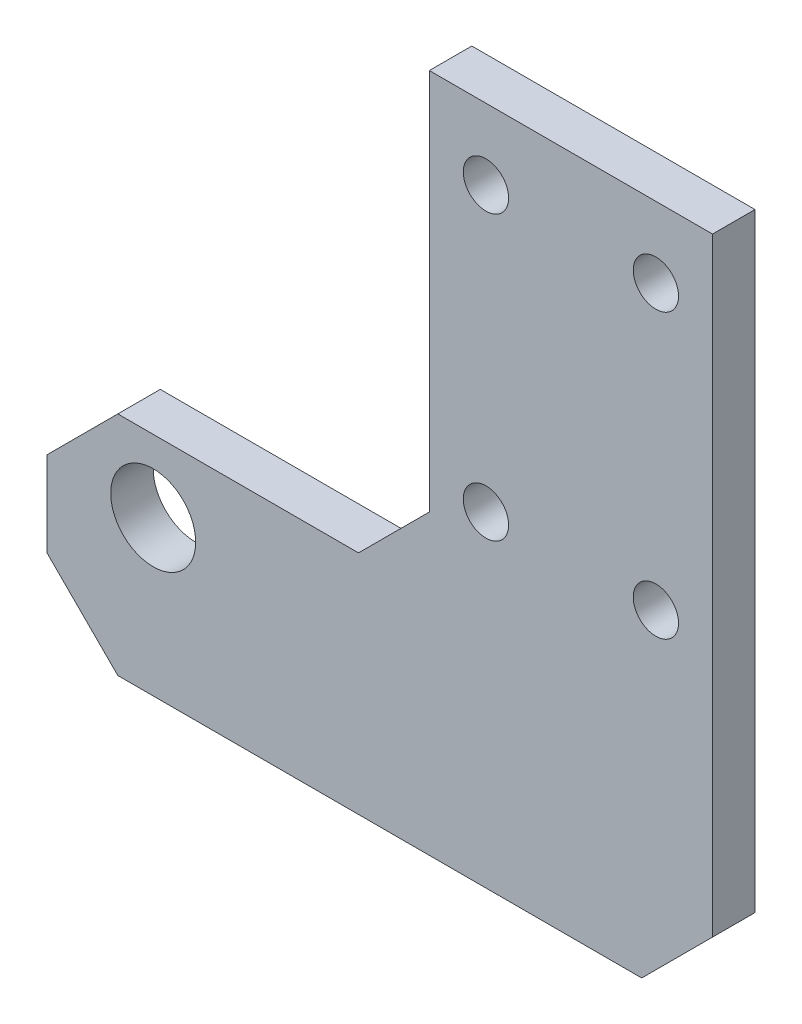
ISO-10303-21;
HEADER;
FILE_DESCRIPTION(('STEP AP214'),'2;1');
FILE_NAME('part.step','',(''),(''),'','','');
FILE_SCHEMA(('AUTOMOTIVE_DESIGN { 1 0 10303 214 1 1 1 1 }'));
ENDSEC;
DATA;
#1=APPLICATION_CONTEXT('core data for automotive mechanical design processes');
#2=APPLICATION_PROTOCOL_DEFINITION('international standard','automotive_design',2000,#1);
#3=PRODUCT_CONTEXT('',#1,'mechanical');
#4=PRODUCT('Part','Part','',(#3));
#5=PRODUCT_RELATED_PRODUCT_CATEGORY('part','',(#4));
#6=PRODUCT_DEFINITION_FORMATION('','',#4);
#7=PRODUCT_DEFINITION_CONTEXT('part definition',#1,'design');
#8=PRODUCT_DEFINITION('design','',#6,#7);
#9=PRODUCT_DEFINITION_SHAPE('','',#8);
#10=(LENGTH_UNIT() NAMED_UNIT(*) SI_UNIT(.MILLI.,.METRE.));
#11=(NAMED_UNIT(*) PLANE_ANGLE_UNIT() SI_UNIT($,.RADIAN.));
#12=(NAMED_UNIT(*) SI_UNIT($,.STERADIAN.) SOLID_ANGLE_UNIT());
#13=UNCERTAINTY_MEASURE_WITH_UNIT(LENGTH_MEASURE(1.E-05),#10,'distance_accuracy_value','');
#14=(GEOMETRIC_REPRESENTATION_CONTEXT(3) GLOBAL_UNCERTAINTY_ASSIGNED_CONTEXT((#13)) GLOBAL_UNIT_ASSIGNED_CONTEXT((#10,
#11,#12)) REPRESENTATION_CONTEXT('',''));
#15=CARTESIAN_POINT('',(0.,0.,0.));
#16=DIRECTION('',(0.,0.,1.));
#17=DIRECTION('',(1.,0.,0.));
#18=AXIS2_PLACEMENT_3D('',#15,#16,#17);
#19=CARTESIAN_POINT('',(0.,0.,3.));
#20=DIRECTION('',(0.,0.,-1.));
#21=DIRECTION('',(-1.,0.,0.));
#22=AXIS2_PLACEMENT_3D('',#19,#20,#21);
#23=PLANE('',#22);
#24=DIRECTION('',(0.,-1.,0.));
#25=VECTOR('',#24,1.);
#26=CARTESIAN_POINT('',(330.612129760226,-150.,3.));
#27=LINE('',#26,#25);
#28=CARTESIAN_POINT('',(330.612129760226,-150.,3.));
#29=VERTEX_POINT('',#28);
#30=CARTESIAN_POINT('',(330.612129760226,-177.,3.));
#31=VERTEX_POINT('',#30);
#32=EDGE_CURVE('E164',#29,#31,#27,.T.);
#33=ORIENTED_EDGE('',*,*,#32,.T.);
#34=DIRECTION('',(-0.707106781186547,-0.707106781186547,0.));
#35=VECTOR('',#34,1.);
#36=CARTESIAN_POINT('',(330.612129760226,-177.,3.));
#37=LINE('',#36,#35);
#38=CARTESIAN_POINT('',(325.612129760226,-182.,3.));
#39=VERTEX_POINT('',#38);
#40=EDGE_CURVE('E101',#31,#39,#37,.T.);
#41=ORIENTED_EDGE('',*,*,#40,.T.);
#42=DIRECTION('',(-1.,0.,0.));
#43=VECTOR('',#42,1.);
#44=CARTESIAN_POINT('',(325.612129760226,-182.,3.));
#45=LINE('',#44,#43);
#46=CARTESIAN_POINT('',(308.612129760226,-182.,3.));
#47=VERTEX_POINT('',#46);
#48=EDGE_CURVE('E185',#39,#47,#45,.T.);
#49=ORIENTED_EDGE('',*,*,#48,.T.);
#50=DIRECTION('',(-0.707106781186547,-0.707106781186547,0.));
#51=VECTOR('',#50,1.);
#52=CARTESIAN_POINT('',(308.612129760226,-182.,3.));
#53=LINE('',#52,#51);
#54=CARTESIAN_POINT('',(303.612129760226,-187.,3.));
#55=VERTEX_POINT('',#54);
#56=EDGE_CURVE('E204',#47,#55,#53,.T.);
#57=ORIENTED_EDGE('',*,*,#56,.T.);
#58=DIRECTION('',(0.,-1.,0.));
#59=VECTOR('',#58,1.);
#60=CARTESIAN_POINT('',(303.612129760226,-193.,3.));
#61=LINE('',#60,#59);
#62=CARTESIAN_POINT('',(303.612129760226,-193.,3.));
#63=VERTEX_POINT('',#62);
#64=EDGE_CURVE('E201',#55,#63,#61,.T.);
#65=ORIENTED_EDGE('',*,*,#64,.T.);
#66=DIRECTION('',(0.707106781186547,-0.707106781186547,0.));
#67=VECTOR('',#66,1.);
#68=CARTESIAN_POINT('',(308.612129760226,-198.,3.));
#69=LINE('',#68,#67);
#70=CARTESIAN_POINT('',(308.612129760226,-198.,3.));
#71=VERTEX_POINT('',#70);
#72=EDGE_CURVE('E203',#63,#71,#69,.T.);
#73=ORIENTED_EDGE('',*,*,#72,.T.);
#74=DIRECTION('',(1.,0.,0.));
#75=VECTOR('',#74,1.);
#76=CARTESIAN_POINT('',(330.612129760226,-198.,3.));
#77=LINE('',#76,#75);
#78=CARTESIAN_POINT('',(345.612129760226,-198.,3.));
#79=VERTEX_POINT('',#78);
#80=EDGE_CURVE('E126',#71,#79,#77,.T.);
#81=ORIENTED_EDGE('',*,*,#80,.T.);
#82=DIRECTION('',(0.707106781186547,0.707106781186547,0.));
#83=VECTOR('',#82,1.);
#84=CARTESIAN_POINT('',(345.612129760226,-198.,3.));
#85=LINE('',#84,#83);
#86=CARTESIAN_POINT('',(350.612129760226,-193.,3.));
#87=VERTEX_POINT('',#86);
#88=EDGE_CURVE('E120',#79,#87,#85,.T.);
#89=ORIENTED_EDGE('',*,*,#88,.T.);
#90=DIRECTION('',(0.,1.,0.));
#91=VECTOR('',#90,1.);
#92=CARTESIAN_POINT('',(350.612129760226,-150.,3.));
#93=LINE('',#92,#91);
#94=CARTESIAN_POINT('',(350.612129760226,-150.,3.));
#95=VERTEX_POINT('',#94);
#96=EDGE_CURVE('E124',#87,#95,#93,.T.);
#97=ORIENTED_EDGE('',*,*,#96,.T.);
#98=DIRECTION('',(-1.,0.,0.));
#99=VECTOR('',#98,1.);
#100=CARTESIAN_POINT('',(330.612129760226,-150.,3.));
#101=LINE('',#100,#99);
#102=EDGE_CURVE('E52',#95,#29,#101,.T.);
#103=ORIENTED_EDGE('',*,*,#102,.T.);
#104=EDGE_LOOP('',(#33,#41,#49,#57,#65,#73,#81,#89,#97,#103));
#105=FACE_BOUND('',#104,.T.);
#106=CARTESIAN_POINT('',(311.112129760226,-187.1,3.));
#107=DIRECTION('',(0.,0.,1.));
#108=DIRECTION('',(1.,0.,0.));
#109=AXIS2_PLACEMENT_3D('',#106,#107,#108);
#110=CIRCLE('',#109,2.99999999999999);
#111=CARTESIAN_POINT('',(314.112129760226,-187.1,3.));
#112=VERTEX_POINT('',#111);
#113=EDGE_CURVE('E148',#112,#112,#110,.T.);
#114=ORIENTED_EDGE('',*,*,#113,.F.);
#115=EDGE_LOOP('',(#114));
#116=FACE_BOUND('',#115,.T.);
#117=CARTESIAN_POINT('',(334.612129760226,-155.,3.));
#118=DIRECTION('',(0.,0.,1.));
#119=DIRECTION('',(1.,0.,0.));
#120=AXIS2_PLACEMENT_3D('',#117,#118,#119);
#121=CIRCLE('',#120,1.59999999999996);
#122=CARTESIAN_POINT('',(336.212129760226,-155.,3.));
#123=VERTEX_POINT('',#122);
#124=EDGE_CURVE('E215',#123,#123,#121,.T.);
#125=ORIENTED_EDGE('',*,*,#124,.F.);
#126=EDGE_LOOP('',(#125));
#127=FACE_BOUND('',#126,.T.);
#128=CARTESIAN_POINT('',(346.612129760226,-155.,3.));
#129=DIRECTION('',(0.,0.,1.));
#130=DIRECTION('',(1.,0.,0.));
#131=AXIS2_PLACEMENT_3D('',#128,#129,#130);
#132=CIRCLE('',#131,1.59999999999996);
#133=CARTESIAN_POINT('',(348.212129760226,-155.,3.));
#134=VERTEX_POINT('',#133);
#135=EDGE_CURVE('E221',#134,#134,#132,.T.);
#136=ORIENTED_EDGE('',*,*,#135,.F.);
#137=EDGE_LOOP('',(#136));
#138=FACE_BOUND('',#137,.T.);
#139=CARTESIAN_POINT('',(334.612129760226,-175.,3.));
#140=DIRECTION('',(0.,0.,1.));
#141=DIRECTION('',(1.,0.,0.));
#142=AXIS2_PLACEMENT_3D('',#139,#140,#141);
#143=CIRCLE('',#142,1.59999999999996);
#144=CARTESIAN_POINT('',(336.212129760226,-175.,3.));
#145=VERTEX_POINT('',#144);
#146=EDGE_CURVE('E227',#145,#145,#143,.T.);
#147=ORIENTED_EDGE('',*,*,#146,.F.);
#148=EDGE_LOOP('',(#147));
#149=FACE_BOUND('',#148,.T.);
#150=CARTESIAN_POINT('',(346.612129760226,-175.,3.));
#151=DIRECTION('',(0.,0.,1.));
#152=DIRECTION('',(1.,0.,0.));
#153=AXIS2_PLACEMENT_3D('',#150,#151,#152);
#154=CIRCLE('',#153,1.59999999999996);
#155=CARTESIAN_POINT('',(348.212129760226,-175.,3.));
#156=VERTEX_POINT('',#155);
#157=EDGE_CURVE('E233',#156,#156,#154,.T.);
#158=ORIENTED_EDGE('',*,*,#157,.F.);
#159=EDGE_LOOP('',(#158));
#160=FACE_BOUND('',#159,.T.);
#161=ADVANCED_FACE('F35',(#105,#116,#127,#138,#149,#160),#23,.F.);
#162=CARTESIAN_POINT('',(0.,0.,0.));
#163=DIRECTION('',(0.,0.,-1.));
#164=DIRECTION('',(-1.,0.,0.));
#165=AXIS2_PLACEMENT_3D('',#162,#163,#164);
#166=PLANE('',#165);
#167=CARTESIAN_POINT('',(334.612129760226,-175.,0.));
#168=DIRECTION('',(0.,0.,1.));
#169=DIRECTION('',(1.,0.,0.));
#170=AXIS2_PLACEMENT_3D('',#167,#168,#169);
#171=CIRCLE('',#170,1.59999999999996);
#172=CARTESIAN_POINT('',(336.212129760226,-175.,0.));
#173=VERTEX_POINT('',#172);
#174=EDGE_CURVE('E230',#173,#173,#171,.T.);
#175=ORIENTED_EDGE('',*,*,#174,.T.);
#176=EDGE_LOOP('',(#175));
#177=FACE_BOUND('',#176,.T.);
#178=CARTESIAN_POINT('',(334.612129760226,-155.,0.));
#179=DIRECTION('',(0.,0.,1.));
#180=DIRECTION('',(1.,0.,0.));
#181=AXIS2_PLACEMENT_3D('',#178,#179,#180);
#182=CIRCLE('',#181,1.59999999999996);
#183=CARTESIAN_POINT('',(336.212129760226,-155.,0.));
#184=VERTEX_POINT('',#183);
#185=EDGE_CURVE('E218',#184,#184,#182,.T.);
#186=ORIENTED_EDGE('',*,*,#185,.T.);
#187=EDGE_LOOP('',(#186));
#188=FACE_BOUND('',#187,.T.);
#189=DIRECTION('',(0.,-1.,0.));
#190=VECTOR('',#189,1.);
#191=CARTESIAN_POINT('',(330.612129760226,-150.,0.));
#192=LINE('',#191,#190);
#193=CARTESIAN_POINT('',(330.612129760226,-150.,0.));
#194=VERTEX_POINT('',#193);
#195=CARTESIAN_POINT('',(330.612129760226,-177.,0.));
#196=VERTEX_POINT('',#195);
#197=EDGE_CURVE('E144',#194,#196,#192,.T.);
#198=ORIENTED_EDGE('',*,*,#197,.F.);
#199=DIRECTION('',(-1.,0.,0.));
#200=VECTOR('',#199,1.);
#201=CARTESIAN_POINT('',(330.612129760226,-150.,0.));
#202=LINE('',#201,#200);
#203=CARTESIAN_POINT('',(350.612129760226,-150.,0.));
#204=VERTEX_POINT('',#203);
#205=EDGE_CURVE('E93',#204,#194,#202,.T.);
#206=ORIENTED_EDGE('',*,*,#205,.F.);
#207=DIRECTION('',(0.,1.,0.));
#208=VECTOR('',#207,1.);
#209=CARTESIAN_POINT('',(350.612129760226,-150.,0.));
#210=LINE('',#209,#208);
#211=CARTESIAN_POINT('',(350.612129760226,-193.,0.));
#212=VERTEX_POINT('',#211);
#213=EDGE_CURVE('E87',#212,#204,#210,.T.);
#214=ORIENTED_EDGE('',*,*,#213,.F.);
#215=DIRECTION('',(0.707106781186547,0.707106781186547,0.));
#216=VECTOR('',#215,1.);
#217=CARTESIAN_POINT('',(345.612129760226,-198.,0.));
#218=LINE('',#217,#216);
#219=CARTESIAN_POINT('',(345.612129760226,-198.,0.));
#220=VERTEX_POINT('',#219);
#221=EDGE_CURVE('E134',#220,#212,#218,.T.);
#222=ORIENTED_EDGE('',*,*,#221,.F.);
#223=DIRECTION('',(1.,0.,0.));
#224=VECTOR('',#223,1.);
#225=CARTESIAN_POINT('',(330.612129760226,-198.,0.));
#226=LINE('',#225,#224);
#227=CARTESIAN_POINT('',(308.612129760226,-198.,0.));
#228=VERTEX_POINT('',#227);
#229=EDGE_CURVE('E159',#228,#220,#226,.T.);
#230=ORIENTED_EDGE('',*,*,#229,.F.);
#231=DIRECTION('',(0.707106781186547,-0.707106781186547,0.));
#232=VECTOR('',#231,1.);
#233=CARTESIAN_POINT('',(308.612129760226,-198.,0.));
#234=LINE('',#233,#232);
#235=CARTESIAN_POINT('',(303.612129760226,-193.,0.));
#236=VERTEX_POINT('',#235);
#237=EDGE_CURVE('E156',#236,#228,#234,.T.);
#238=ORIENTED_EDGE('',*,*,#237,.F.);
#239=DIRECTION('',(0.,-1.,0.));
#240=VECTOR('',#239,1.);
#241=CARTESIAN_POINT('',(303.612129760226,-193.,0.));
#242=LINE('',#241,#240);
#243=CARTESIAN_POINT('',(303.612129760226,-187.,0.));
#244=VERTEX_POINT('',#243);
#245=EDGE_CURVE('E154',#244,#236,#242,.T.);
#246=ORIENTED_EDGE('',*,*,#245,.F.);
#247=DIRECTION('',(-0.707106781186547,-0.707106781186547,0.));
#248=VECTOR('',#247,1.);
#249=CARTESIAN_POINT('',(308.612129760226,-182.,0.));
#250=LINE('',#249,#248);
#251=CARTESIAN_POINT('',(308.612129760226,-182.,0.));
#252=VERTEX_POINT('',#251);
#253=EDGE_CURVE('E152',#252,#244,#250,.T.);
#254=ORIENTED_EDGE('',*,*,#253,.F.);
#255=DIRECTION('',(-1.,0.,0.));
#256=VECTOR('',#255,1.);
#257=CARTESIAN_POINT('',(325.612129760226,-182.,0.));
#258=LINE('',#257,#256);
#259=CARTESIAN_POINT('',(325.612129760226,-182.,0.));
#260=VERTEX_POINT('',#259);
#261=EDGE_CURVE('E150',#260,#252,#258,.T.);
#262=ORIENTED_EDGE('',*,*,#261,.F.);
#263=DIRECTION('',(-0.707106781186547,-0.707106781186547,0.));
#264=VECTOR('',#263,1.);
#265=CARTESIAN_POINT('',(330.612129760226,-177.,0.));
#266=LINE('',#265,#264);
#267=EDGE_CURVE('E147',#196,#260,#266,.T.);
#268=ORIENTED_EDGE('',*,*,#267,.F.);
#269=EDGE_LOOP('',(#198,#206,#214,#222,#230,#238,#246,#254,#262,#268));
#270=FACE_BOUND('',#269,.T.);
#271=CARTESIAN_POINT('',(311.112129760226,-187.1,0.));
#272=DIRECTION('',(0.,0.,1.));
#273=DIRECTION('',(1.,0.,0.));
#274=AXIS2_PLACEMENT_3D('',#271,#272,#273);
#275=CIRCLE('',#274,2.99999999999999);
#276=CARTESIAN_POINT('',(314.112129760226,-187.1,0.));
#277=VERTEX_POINT('',#276);
#278=EDGE_CURVE('E212',#277,#277,#275,.T.);
#279=ORIENTED_EDGE('',*,*,#278,.T.);
#280=EDGE_LOOP('',(#279));
#281=FACE_BOUND('',#280,.T.);
#282=CARTESIAN_POINT('',(346.612129760226,-155.,0.));
#283=DIRECTION('',(0.,0.,1.));
#284=DIRECTION('',(1.,0.,0.));
#285=AXIS2_PLACEMENT_3D('',#282,#283,#284);
#286=CIRCLE('',#285,1.59999999999996);
#287=CARTESIAN_POINT('',(348.212129760226,-155.,0.));
#288=VERTEX_POINT('',#287);
#289=EDGE_CURVE('E224',#288,#288,#286,.T.);
#290=ORIENTED_EDGE('',*,*,#289,.T.);
#291=EDGE_LOOP('',(#290));
#292=FACE_BOUND('',#291,.T.);
#293=CARTESIAN_POINT('',(346.612129760226,-175.,0.));
#294=DIRECTION('',(0.,0.,1.));
#295=DIRECTION('',(1.,0.,0.));
#296=AXIS2_PLACEMENT_3D('',#293,#294,#295);
#297=CIRCLE('',#296,1.59999999999996);
#298=CARTESIAN_POINT('',(348.212129760226,-175.,0.));
#299=VERTEX_POINT('',#298);
#300=EDGE_CURVE('E236',#299,#299,#297,.T.);
#301=ORIENTED_EDGE('',*,*,#300,.T.);
#302=EDGE_LOOP('',(#301));
#303=FACE_BOUND('',#302,.T.);
#304=ADVANCED_FACE('F189',(#177,#188,#270,#281,#292,#303),#166,.T.);
#305=CARTESIAN_POINT('',(330.612129760226,-150.,3.));
#306=DIRECTION('',(1.,0.,0.));
#307=DIRECTION('',(0.,0.,-1.));
#308=AXIS2_PLACEMENT_3D('',#305,#306,#307);
#309=PLANE('',#308);
#310=ORIENTED_EDGE('',*,*,#197,.T.);
#311=DIRECTION('',(0.,0.,-1.));
#312=VECTOR('',#311,1.);
#313=CARTESIAN_POINT('',(330.612129760226,-177.,3.));
#314=LINE('',#313,#312);
#315=EDGE_CURVE('E11',#31,#196,#314,.T.);
#316=ORIENTED_EDGE('',*,*,#315,.F.);
#317=ORIENTED_EDGE('',*,*,#32,.F.);
#318=DIRECTION('',(0.,0.,-1.));
#319=VECTOR('',#318,1.);
#320=CARTESIAN_POINT('',(330.612129760226,-150.,3.));
#321=LINE('',#320,#319);
#322=EDGE_CURVE('E140',#29,#194,#321,.T.);
#323=ORIENTED_EDGE('',*,*,#322,.T.);
#324=EDGE_LOOP('',(#310,#316,#317,#323));
#325=FACE_BOUND('',#324,.T.);
#326=ADVANCED_FACE('F37',(#325),#309,.F.);
#327=CARTESIAN_POINT('',(330.612129760226,-177.,3.));
#328=DIRECTION('',(0.707106781186548,-0.707106781186548,0.));
#329=DIRECTION('',(0.707106781186548,0.707106781186548,0.));
#330=AXIS2_PLACEMENT_3D('',#327,#328,#329);
#331=PLANE('',#330);
#332=ORIENTED_EDGE('',*,*,#267,.T.);
#333=DIRECTION('',(0.,0.,-1.));
#334=VECTOR('',#333,1.);
#335=CARTESIAN_POINT('',(325.612129760226,-182.,3.));
#336=LINE('',#335,#334);
#337=EDGE_CURVE('E44',#39,#260,#336,.T.);
#338=ORIENTED_EDGE('',*,*,#337,.F.);
#339=ORIENTED_EDGE('',*,*,#40,.F.);
#340=ORIENTED_EDGE('',*,*,#315,.T.);
#341=EDGE_LOOP('',(#332,#338,#339,#340));
#342=FACE_BOUND('',#341,.T.);
#343=ADVANCED_FACE('F276',(#342),#331,.F.);
#344=CARTESIAN_POINT('',(325.612129760226,-182.,3.));
#345=DIRECTION('',(0.,-1.,0.));
#346=DIRECTION('',(0.,0.,-1.));
#347=AXIS2_PLACEMENT_3D('',#344,#345,#346);
#348=PLANE('',#347);
#349=ORIENTED_EDGE('',*,*,#261,.T.);
#350=DIRECTION('',(0.,0.,-1.));
#351=VECTOR('',#350,1.);
#352=CARTESIAN_POINT('',(308.612129760226,-182.,3.));
#353=LINE('',#352,#351);
#354=EDGE_CURVE('E177',#47,#252,#353,.T.);
#355=ORIENTED_EDGE('',*,*,#354,.F.);
#356=ORIENTED_EDGE('',*,*,#48,.F.);
#357=ORIENTED_EDGE('',*,*,#337,.T.);
#358=EDGE_LOOP('',(#349,#355,#356,#357));
#359=FACE_BOUND('',#358,.T.);
#360=ADVANCED_FACE('F183',(#359),#348,.F.);
#361=CARTESIAN_POINT('',(308.612129760226,-182.,3.));
#362=DIRECTION('',(0.707106781186548,-0.707106781186548,0.));
#363=DIRECTION('',(0.707106781186548,0.707106781186548,0.));
#364=AXIS2_PLACEMENT_3D('',#361,#362,#363);
#365=PLANE('',#364);
#366=ORIENTED_EDGE('',*,*,#253,.T.);
#367=DIRECTION('',(0.,0.,-1.));
#368=VECTOR('',#367,1.);
#369=CARTESIAN_POINT('',(303.612129760226,-187.,3.));
#370=LINE('',#369,#368);
#371=EDGE_CURVE('E174',#55,#244,#370,.T.);
#372=ORIENTED_EDGE('',*,*,#371,.F.);
#373=ORIENTED_EDGE('',*,*,#56,.F.);
#374=ORIENTED_EDGE('',*,*,#354,.T.);
#375=EDGE_LOOP('',(#366,#372,#373,#374));
#376=FACE_BOUND('',#375,.T.);
#377=ADVANCED_FACE('F195',(#376),#365,.F.);
#378=CARTESIAN_POINT('',(303.612129760226,-193.,3.));
#379=DIRECTION('',(1.,0.,0.));
#380=DIRECTION('',(0.,0.,-1.));
#381=AXIS2_PLACEMENT_3D('',#378,#379,#380);
#382=PLANE('',#381);
#383=ORIENTED_EDGE('',*,*,#245,.T.);
#384=DIRECTION('',(0.,0.,-1.));
#385=VECTOR('',#384,1.);
#386=CARTESIAN_POINT('',(303.612129760226,-193.,3.));
#387=LINE('',#386,#385);
#388=EDGE_CURVE('E171',#63,#236,#387,.T.);
#389=ORIENTED_EDGE('',*,*,#388,.F.);
#390=ORIENTED_EDGE('',*,*,#64,.F.);
#391=ORIENTED_EDGE('',*,*,#371,.T.);
#392=EDGE_LOOP('',(#383,#389,#390,#391));
#393=FACE_BOUND('',#392,.T.);
#394=ADVANCED_FACE('F199',(#393),#382,.F.);
#395=CARTESIAN_POINT('',(308.612129760226,-198.,3.));
#396=DIRECTION('',(0.707106781186548,0.707106781186548,0.));
#397=DIRECTION('',(-0.707106781186548,0.707106781186548,0.));
#398=AXIS2_PLACEMENT_3D('',#395,#396,#397);
#399=PLANE('',#398);
#400=ORIENTED_EDGE('',*,*,#237,.T.);
#401=DIRECTION('',(0.,0.,-1.));
#402=VECTOR('',#401,1.);
#403=CARTESIAN_POINT('',(308.612129760226,-198.,3.));
#404=LINE('',#403,#402);
#405=EDGE_CURVE('E168',#71,#228,#404,.T.);
#406=ORIENTED_EDGE('',*,*,#405,.F.);
#407=ORIENTED_EDGE('',*,*,#72,.F.);
#408=ORIENTED_EDGE('',*,*,#388,.T.);
#409=EDGE_LOOP('',(#400,#406,#407,#408));
#410=FACE_BOUND('',#409,.T.);
#411=ADVANCED_FACE('F266',(#410),#399,.F.);
#412=CARTESIAN_POINT('',(330.612129760226,-198.,3.));
#413=DIRECTION('',(0.,1.,0.));
#414=DIRECTION('',(0.,0.,1.));
#415=AXIS2_PLACEMENT_3D('',#412,#413,#414);
#416=PLANE('',#415);
#417=ORIENTED_EDGE('',*,*,#229,.T.);
#418=DIRECTION('',(0.,0.,-1.));
#419=VECTOR('',#418,1.);
#420=CARTESIAN_POINT('',(345.612129760226,-198.,3.));
#421=LINE('',#420,#419);
#422=EDGE_CURVE('E135',#79,#220,#421,.T.);
#423=ORIENTED_EDGE('',*,*,#422,.F.);
#424=ORIENTED_EDGE('',*,*,#80,.F.);
#425=ORIENTED_EDGE('',*,*,#405,.T.);
#426=EDGE_LOOP('',(#417,#423,#424,#425));
#427=FACE_BOUND('',#426,.T.);
#428=ADVANCED_FACE('F263',(#427),#416,.F.);
#429=CARTESIAN_POINT('',(345.612129760226,-198.,3.));
#430=DIRECTION('',(-0.707106781186548,0.707106781186548,0.));
#431=DIRECTION('',(-0.707106781186548,-0.707106781186548,0.));
#432=AXIS2_PLACEMENT_3D('',#429,#430,#431);
#433=PLANE('',#432);
#434=ORIENTED_EDGE('',*,*,#221,.T.);
#435=DIRECTION('',(0.,0.,-1.));
#436=VECTOR('',#435,1.);
#437=CARTESIAN_POINT('',(350.612129760226,-193.,3.));
#438=LINE('',#437,#436);
#439=EDGE_CURVE('E131',#87,#212,#438,.T.);
#440=ORIENTED_EDGE('',*,*,#439,.F.);
#441=ORIENTED_EDGE('',*,*,#88,.F.);
#442=ORIENTED_EDGE('',*,*,#422,.T.);
#443=EDGE_LOOP('',(#434,#440,#441,#442));
#444=FACE_BOUND('',#443,.T.);
#445=ADVANCED_FACE('F132',(#444),#433,.F.);
#446=CARTESIAN_POINT('',(350.612129760226,-150.,3.));
#447=DIRECTION('',(-1.,0.,0.));
#448=DIRECTION('',(0.,0.,1.));
#449=AXIS2_PLACEMENT_3D('',#446,#447,#448);
#450=PLANE('',#449);
#451=ORIENTED_EDGE('',*,*,#213,.T.);
#452=DIRECTION('',(0.,0.,-1.));
#453=VECTOR('',#452,1.);
#454=CARTESIAN_POINT('',(350.612129760226,-150.,3.));
#455=LINE('',#454,#453);
#456=EDGE_CURVE('E136',#95,#204,#455,.T.);
#457=ORIENTED_EDGE('',*,*,#456,.F.);
#458=ORIENTED_EDGE('',*,*,#96,.F.);
#459=ORIENTED_EDGE('',*,*,#439,.T.);
#460=EDGE_LOOP('',(#451,#457,#458,#459));
#461=FACE_BOUND('',#460,.T.);
#462=ADVANCED_FACE('F138',(#461),#450,.F.);
#463=CARTESIAN_POINT('',(330.612129760226,-150.,3.));
#464=DIRECTION('',(0.,-1.,0.));
#465=DIRECTION('',(0.,0.,-1.));
#466=AXIS2_PLACEMENT_3D('',#463,#464,#465);
#467=PLANE('',#466);
#468=ORIENTED_EDGE('',*,*,#205,.T.);
#469=ORIENTED_EDGE('',*,*,#322,.F.);
#470=ORIENTED_EDGE('',*,*,#102,.F.);
#471=ORIENTED_EDGE('',*,*,#456,.T.);
#472=EDGE_LOOP('',(#468,#469,#470,#471));
#473=FACE_BOUND('',#472,.T.);
#474=ADVANCED_FACE('F256',(#473),#467,.F.);
#475=CARTESIAN_POINT('',(311.112129760226,-187.1,3.));
#476=DIRECTION('',(0.,0.,-1.));
#477=DIRECTION('',(-1.,0.,0.));
#478=AXIS2_PLACEMENT_3D('',#475,#476,#477);
#479=CYLINDRICAL_SURFACE('',#478,2.99999999999999);
#480=ORIENTED_EDGE('',*,*,#113,.T.);
#481=EDGE_LOOP('',(#480));
#482=FACE_BOUND('',#481,.T.);
#483=ORIENTED_EDGE('',*,*,#278,.F.);
#484=EDGE_LOOP('',(#483));
#485=FACE_BOUND('',#484,.T.);
#486=ADVANCED_FACE('F253',(#482,#485),#479,.F.);
#487=CARTESIAN_POINT('',(334.612129760226,-155.,3.));
#488=DIRECTION('',(0.,0.,-1.));
#489=DIRECTION('',(-1.,0.,0.));
#490=AXIS2_PLACEMENT_3D('',#487,#488,#489);
#491=CYLINDRICAL_SURFACE('',#490,1.59999999999996);
#492=ORIENTED_EDGE('',*,*,#124,.T.);
#493=EDGE_LOOP('',(#492));
#494=FACE_BOUND('',#493,.T.);
#495=ORIENTED_EDGE('',*,*,#185,.F.);
#496=EDGE_LOOP('',(#495));
#497=FACE_BOUND('',#496,.T.);
#498=ADVANCED_FACE('F354',(#494,#497),#491,.F.);
#499=CARTESIAN_POINT('',(346.612129760226,-155.,3.));
#500=DIRECTION('',(0.,0.,-1.));
#501=DIRECTION('',(-1.,0.,0.));
#502=AXIS2_PLACEMENT_3D('',#499,#500,#501);
#503=CYLINDRICAL_SURFACE('',#502,1.59999999999996);
#504=ORIENTED_EDGE('',*,*,#135,.T.);
#505=EDGE_LOOP('',(#504));
#506=FACE_BOUND('',#505,.T.);
#507=ORIENTED_EDGE('',*,*,#289,.F.);
#508=EDGE_LOOP('',(#507));
#509=FACE_BOUND('',#508,.T.);
#510=ADVANCED_FACE('F362',(#506,#509),#503,.F.);
#511=CARTESIAN_POINT('',(334.612129760226,-175.,3.));
#512=DIRECTION('',(0.,0.,-1.));
#513=DIRECTION('',(-1.,0.,0.));
#514=AXIS2_PLACEMENT_3D('',#511,#512,#513);
#515=CYLINDRICAL_SURFACE('',#514,1.59999999999996);
#516=ORIENTED_EDGE('',*,*,#146,.T.);
#517=EDGE_LOOP('',(#516));
#518=FACE_BOUND('',#517,.T.);
#519=ORIENTED_EDGE('',*,*,#174,.F.);
#520=EDGE_LOOP('',(#519));
#521=FACE_BOUND('',#520,.T.);
#522=ADVANCED_FACE('F370',(#518,#521),#515,.F.);
#523=CARTESIAN_POINT('',(346.612129760226,-175.,3.));
#524=DIRECTION('',(0.,0.,-1.));
#525=DIRECTION('',(-1.,0.,0.));
#526=AXIS2_PLACEMENT_3D('',#523,#524,#525);
#527=CYLINDRICAL_SURFACE('',#526,1.59999999999996);
#528=ORIENTED_EDGE('',*,*,#157,.T.);
#529=EDGE_LOOP('',(#528));
#530=FACE_BOUND('',#529,.T.);
#531=ORIENTED_EDGE('',*,*,#300,.F.);
#532=EDGE_LOOP('',(#531));
#533=FACE_BOUND('',#532,.T.);
#534=ADVANCED_FACE('F242',(#530,#533),#527,.F.);
#535=CLOSED_SHELL('',(#161,#304,#326,#343,#360,#377,#394,#411,#428,#445,#462,#474,#486,#498,
#510,#522,#534));
#536=MANIFOLD_SOLID_BREP('B2',#535);
#537=ADVANCED_BREP_SHAPE_REPRESENTATION('',(#18,#536),#14);
#538=SHAPE_DEFINITION_REPRESENTATION(#9,#537);
ENDSEC;
END-ISO-10303-21;
